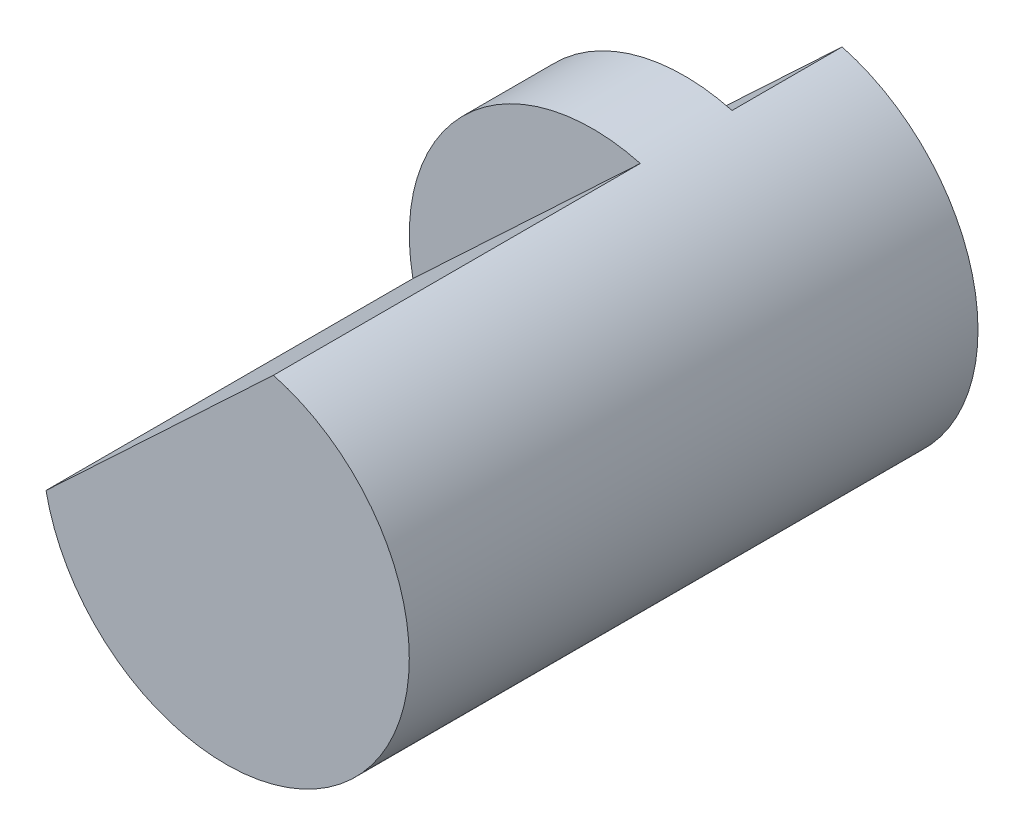
ISO-10303-21;
HEADER;
FILE_DESCRIPTION(('STEP AP214'),'2;1');
FILE_NAME('part.step','',(''),(''),'','','');
FILE_SCHEMA(('AUTOMOTIVE_DESIGN { 1 0 10303 214 1 1 1 1 }'));
ENDSEC;
DATA;
#1=APPLICATION_CONTEXT('core data for automotive mechanical design processes');
#2=APPLICATION_PROTOCOL_DEFINITION('international standard','automotive_design',2000,#1);
#3=PRODUCT_CONTEXT('',#1,'mechanical');
#4=PRODUCT('Part','Part','',(#3));
#5=PRODUCT_RELATED_PRODUCT_CATEGORY('part','',(#4));
#6=PRODUCT_DEFINITION_FORMATION('','',#4);
#7=PRODUCT_DEFINITION_CONTEXT('part definition',#1,'design');
#8=PRODUCT_DEFINITION('design','',#6,#7);
#9=PRODUCT_DEFINITION_SHAPE('','',#8);
#10=(LENGTH_UNIT() NAMED_UNIT(*) SI_UNIT(.MILLI.,.METRE.));
#11=(NAMED_UNIT(*) PLANE_ANGLE_UNIT() SI_UNIT($,.RADIAN.));
#12=(NAMED_UNIT(*) SI_UNIT($,.STERADIAN.) SOLID_ANGLE_UNIT());
#13=UNCERTAINTY_MEASURE_WITH_UNIT(LENGTH_MEASURE(1.E-05),#10,'distance_accuracy_value','');
#14=(GEOMETRIC_REPRESENTATION_CONTEXT(3) GLOBAL_UNCERTAINTY_ASSIGNED_CONTEXT((#13)) GLOBAL_UNIT_ASSIGNED_CONTEXT((#10,
#11,#12)) REPRESENTATION_CONTEXT('',''));
#15=CARTESIAN_POINT('',(0.,0.,0.));
#16=DIRECTION('',(0.,0.,1.));
#17=DIRECTION('',(1.,0.,0.));
#18=AXIS2_PLACEMENT_3D('',#15,#16,#17);
#19=CARTESIAN_POINT('',(0.,0.,19.));
#20=DIRECTION('',(0.,0.,-1.));
#21=DIRECTION('',(-1.,0.,0.));
#22=AXIS2_PLACEMENT_3D('',#19,#20,#21);
#23=CYLINDRICAL_SURFACE('',#22,10.);
#24=DIRECTION('',(0.,0.,-1.));
#25=VECTOR('',#24,1.);
#26=CARTESIAN_POINT('',(-9.80285513889261,-1.97586212218535,31.));
#27=LINE('',#26,#25);
#28=CARTESIAN_POINT('',(-9.80285513889261,-1.97586212218535,31.));
#29=VERTEX_POINT('',#28);
#30=CARTESIAN_POINT('',(-9.80285513889261,-1.97586212218535,11.));
#31=VERTEX_POINT('',#30);
#32=EDGE_CURVE('E76',#29,#31,#27,.T.);
#33=ORIENTED_EDGE('',*,*,#32,.T.);
#34=CARTESIAN_POINT('',(0.,0.,11.));
#35=DIRECTION('',(0.,0.,1.));
#36=DIRECTION('',(1.,0.,0.));
#37=AXIS2_PLACEMENT_3D('',#34,#35,#36);
#38=CIRCLE('',#37,10.);
#39=CARTESIAN_POINT('',(2.59282560627587,9.65801508465586,11.));
#40=VERTEX_POINT('',#39);
#41=EDGE_CURVE('E79',#40,#31,#38,.T.);
#42=ORIENTED_EDGE('',*,*,#41,.F.);
#43=DIRECTION('',(0.,0.,-1.));
#44=VECTOR('',#43,1.);
#45=CARTESIAN_POINT('',(2.59282560627587,9.65801508465586,31.));
#46=LINE('',#45,#44);
#47=CARTESIAN_POINT('',(2.59282560627587,9.65801508465586,31.));
#48=VERTEX_POINT('',#47);
#49=EDGE_CURVE('E84',#48,#40,#46,.T.);
#50=ORIENTED_EDGE('',*,*,#49,.F.);
#51=CARTESIAN_POINT('',(0.,0.,31.));
#52=DIRECTION('',(0.,0.,1.));
#53=DIRECTION('',(1.,0.,0.));
#54=AXIS2_PLACEMENT_3D('',#51,#52,#53);
#55=CIRCLE('',#54,10.);
#56=EDGE_CURVE('E81',#29,#48,#55,.T.);
#57=ORIENTED_EDGE('',*,*,#56,.F.);
#58=EDGE_LOOP('',(#33,#42,#50,#57));
#59=FACE_BOUND('',#58,.T.);
#60=CARTESIAN_POINT('',(0.,0.,6.));
#61=DIRECTION('',(0.,0.,-1.));
#62=DIRECTION('',(-1.,0.,0.));
#63=AXIS2_PLACEMENT_3D('',#60,#61,#62);
#64=CIRCLE('',#63,10.);
#65=CARTESIAN_POINT('',(-9.80285513889261,-1.97586212218535,6.));
#66=VERTEX_POINT('',#65);
#67=CARTESIAN_POINT('',(2.59282560627587,9.65801508465587,6.));
#68=VERTEX_POINT('',#67);
#69=EDGE_CURVE('E98',#66,#68,#64,.T.);
#70=ORIENTED_EDGE('',*,*,#69,.F.);
#71=DIRECTION('',(0.,0.,-1.));
#72=VECTOR('',#71,1.);
#73=CARTESIAN_POINT('',(-9.80285513889261,-1.97586212218535,19.));
#74=LINE('',#73,#72);
#75=CARTESIAN_POINT('',(-9.80285513889261,-1.97586212218535,0.));
#76=VERTEX_POINT('',#75);
#77=EDGE_CURVE('E43',#66,#76,#74,.T.);
#78=ORIENTED_EDGE('',*,*,#77,.T.);
#79=CARTESIAN_POINT('',(0.,0.,0.));
#80=DIRECTION('',(0.,0.,1.));
#81=DIRECTION('',(1.,0.,0.));
#82=AXIS2_PLACEMENT_3D('',#79,#80,#81);
#83=CIRCLE('',#82,10.);
#84=CARTESIAN_POINT('',(2.59282560627587,9.65801508465586,0.));
#85=VERTEX_POINT('',#84);
#86=EDGE_CURVE('E103',#76,#85,#83,.T.);
#87=ORIENTED_EDGE('',*,*,#86,.T.);
#88=DIRECTION('',(0.,0.,-1.));
#89=VECTOR('',#88,1.);
#90=CARTESIAN_POINT('',(2.59282560627587,9.65801508465586,19.));
#91=LINE('',#90,#89);
#92=EDGE_CURVE('E11',#68,#85,#91,.T.);
#93=ORIENTED_EDGE('',*,*,#92,.F.);
#94=EDGE_LOOP('',(#70,#78,#87,#93));
#95=FACE_BOUND('',#94,.T.);
#96=ADVANCED_FACE('F36',(#59,#95),#23,.T.);
#97=CARTESIAN_POINT('',(-9.80285513889261,-1.97586212218535,19.));
#98=DIRECTION('',(0.684345718049483,-0.729157690892264,0.));
#99=DIRECTION('',(0.729157690892264,0.684345718049483,0.));
#100=AXIS2_PLACEMENT_3D('',#97,#98,#99);
#101=PLANE('',#100);
#102=ORIENTED_EDGE('',*,*,#77,.F.);
#103=DIRECTION('',(-0.729157690892263,-0.684345718049483,0.));
#104=VECTOR('',#103,1.);
#105=CARTESIAN_POINT('',(2.59282560627587,9.65801508465587,6.));
#106=LINE('',#105,#104);
#107=EDGE_CURVE('E100',#68,#66,#106,.T.);
#108=ORIENTED_EDGE('',*,*,#107,.F.);
#109=ORIENTED_EDGE('',*,*,#92,.T.);
#110=DIRECTION('',(-0.729157690892264,-0.684345718049483,0.));
#111=VECTOR('',#110,1.);
#112=CARTESIAN_POINT('',(-9.80285513889261,-1.97586212218535,0.));
#113=LINE('',#112,#111);
#114=EDGE_CURVE('E105',#85,#76,#113,.T.);
#115=ORIENTED_EDGE('',*,*,#114,.T.);
#116=EDGE_LOOP('',(#102,#108,#109,#115));
#117=FACE_BOUND('',#116,.T.);
#118=ADVANCED_FACE('F107',(#117),#101,.F.);
#119=CARTESIAN_POINT('',(0.,0.,0.));
#120=DIRECTION('',(0.,0.,1.));
#121=DIRECTION('',(1.,0.,0.));
#122=AXIS2_PLACEMENT_3D('',#119,#120,#121);
#123=PLANE('',#122);
#124=ORIENTED_EDGE('',*,*,#86,.F.);
#125=ORIENTED_EDGE('',*,*,#114,.F.);
#126=EDGE_LOOP('',(#124,#125));
#127=FACE_BOUND('',#126,.T.);
#128=ADVANCED_FACE('F109',(#127),#123,.F.);
#129=CARTESIAN_POINT('',(0.,0.,6.));
#130=DIRECTION('',(0.,0.,-1.));
#131=DIRECTION('',(-1.,0.,0.));
#132=AXIS2_PLACEMENT_3D('',#129,#130,#131);
#133=PLANE('',#132);
#134=ORIENTED_EDGE('',*,*,#69,.T.);
#135=ORIENTED_EDGE('',*,*,#107,.T.);
#136=EDGE_LOOP('',(#134,#135));
#137=FACE_BOUND('',#136,.T.);
#138=ADVANCED_FACE('F111',(#137),#133,.T.);
#139=CARTESIAN_POINT('',(2.59282560627587,9.65801508465586,31.));
#140=DIRECTION('',(0.684345718049483,-0.729157690892263,0.));
#141=DIRECTION('',(0.729157690892264,0.684345718049483,0.));
#142=AXIS2_PLACEMENT_3D('',#139,#140,#141);
#143=PLANE('',#142);
#144=ORIENTED_EDGE('',*,*,#49,.T.);
#145=DIRECTION('',(0.729157690892264,0.684345718049483,0.));
#146=VECTOR('',#145,1.);
#147=CARTESIAN_POINT('',(2.59282560627587,9.65801508465586,11.));
#148=LINE('',#147,#146);
#149=EDGE_CURVE('E90',#31,#40,#148,.T.);
#150=ORIENTED_EDGE('',*,*,#149,.F.);
#151=ORIENTED_EDGE('',*,*,#32,.F.);
#152=DIRECTION('',(-0.729157690892264,-0.684345718049483,0.));
#153=VECTOR('',#152,1.);
#154=CARTESIAN_POINT('',(2.59282560627587,9.65801508465586,31.));
#155=LINE('',#154,#153);
#156=EDGE_CURVE('E85',#48,#29,#155,.T.);
#157=ORIENTED_EDGE('',*,*,#156,.F.);
#158=EDGE_LOOP('',(#144,#150,#151,#157));
#159=FACE_BOUND('',#158,.T.);
#160=ADVANCED_FACE('F92',(#159),#143,.F.);
#161=CARTESIAN_POINT('',(0.,0.,31.));
#162=DIRECTION('',(0.,0.,1.));
#163=DIRECTION('',(1.,0.,0.));
#164=AXIS2_PLACEMENT_3D('',#161,#162,#163);
#165=PLANE('',#164);
#166=ORIENTED_EDGE('',*,*,#56,.T.);
#167=ORIENTED_EDGE('',*,*,#156,.T.);
#168=EDGE_LOOP('',(#166,#167));
#169=FACE_BOUND('',#168,.T.);
#170=ADVANCED_FACE('F118',(#169),#165,.T.);
#171=CARTESIAN_POINT('',(0.,0.,11.));
#172=DIRECTION('',(0.,0.,1.));
#173=DIRECTION('',(1.,0.,0.));
#174=AXIS2_PLACEMENT_3D('',#171,#172,#173);
#175=PLANE('',#174);
#176=ORIENTED_EDGE('',*,*,#41,.T.);
#177=ORIENTED_EDGE('',*,*,#149,.T.);
#178=EDGE_LOOP('',(#176,#177));
#179=FACE_BOUND('',#178,.T.);
#180=ADVANCED_FACE('F89',(#179),#175,.T.);
#181=CLOSED_SHELL('',(#96,#118,#128,#138,#160,#170,#180));
#182=MANIFOLD_SOLID_BREP('B2',#181);
#183=ADVANCED_BREP_SHAPE_REPRESENTATION('',(#18,#182),#14);
#184=SHAPE_DEFINITION_REPRESENTATION(#9,#183);
ENDSEC;
END-ISO-10303-21;
